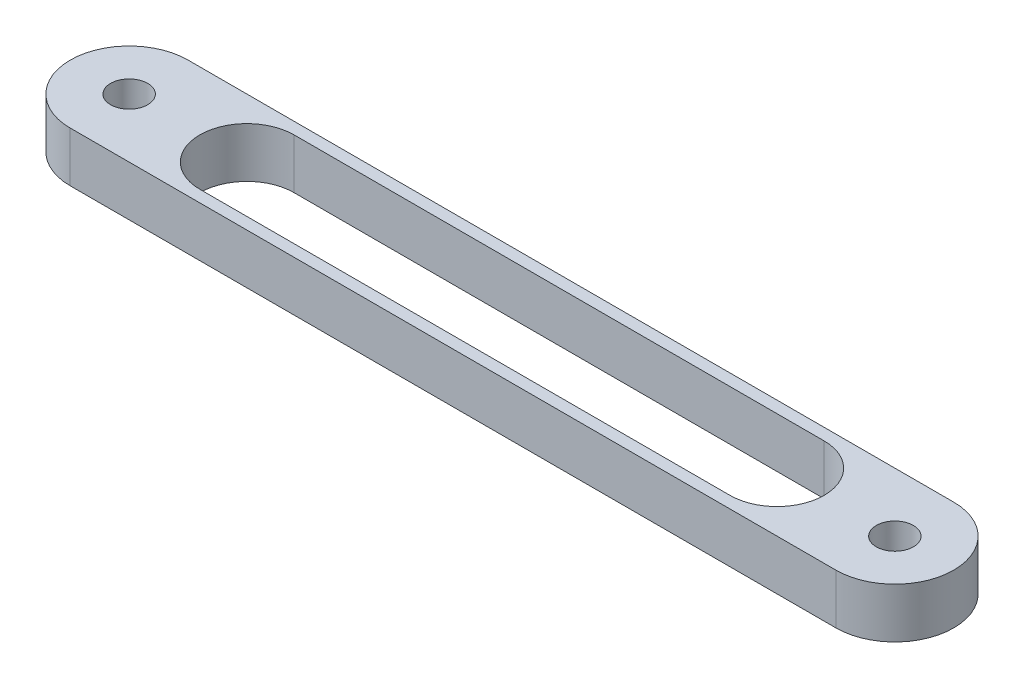
ISO-10303-21;
HEADER;
FILE_DESCRIPTION(('STEP AP214'),'2;1');
FILE_NAME('part.step','',(''),(''),'','','');
FILE_SCHEMA(('AUTOMOTIVE_DESIGN { 1 0 10303 214 1 1 1 1 }'));
ENDSEC;
DATA;
#1=APPLICATION_CONTEXT('core data for automotive mechanical design processes');
#2=APPLICATION_PROTOCOL_DEFINITION('international standard','automotive_design',2000,#1);
#3=PRODUCT_CONTEXT('',#1,'mechanical');
#4=PRODUCT('Part','Part','',(#3));
#5=PRODUCT_RELATED_PRODUCT_CATEGORY('part','',(#4));
#6=PRODUCT_DEFINITION_FORMATION('','',#4);
#7=PRODUCT_DEFINITION_CONTEXT('part definition',#1,'design');
#8=PRODUCT_DEFINITION('design','',#6,#7);
#9=PRODUCT_DEFINITION_SHAPE('','',#8);
#10=(LENGTH_UNIT() NAMED_UNIT(*) SI_UNIT(.MILLI.,.METRE.));
#11=(NAMED_UNIT(*) PLANE_ANGLE_UNIT() SI_UNIT($,.RADIAN.));
#12=(NAMED_UNIT(*) SI_UNIT($,.STERADIAN.) SOLID_ANGLE_UNIT());
#13=UNCERTAINTY_MEASURE_WITH_UNIT(LENGTH_MEASURE(1.E-05),#10,'distance_accuracy_value','');
#14=(GEOMETRIC_REPRESENTATION_CONTEXT(3) GLOBAL_UNCERTAINTY_ASSIGNED_CONTEXT((#13)) GLOBAL_UNIT_ASSIGNED_CONTEXT((#10,
#11,#12)) REPRESENTATION_CONTEXT('',''));
#15=CARTESIAN_POINT('',(0.,0.,0.));
#16=DIRECTION('',(0.,0.,1.));
#17=DIRECTION('',(1.,0.,0.));
#18=AXIS2_PLACEMENT_3D('',#15,#16,#17);
#19=CARTESIAN_POINT('',(0.,4.25,0.));
#20=DIRECTION('',(0.,1.,0.));
#21=DIRECTION('',(0.,0.,1.));
#22=AXIS2_PLACEMENT_3D('',#19,#20,#21);
#23=PLANE('',#22);
#24=CARTESIAN_POINT('',(0.,4.25,0.));
#25=DIRECTION('',(0.,1.,0.));
#26=DIRECTION('',(0.,0.,1.));
#27=AXIS2_PLACEMENT_3D('',#24,#25,#26);
#28=CIRCLE('',#27,3.15);
#29=CARTESIAN_POINT('',(0.,4.25,3.15));
#30=VERTEX_POINT('',#29);
#31=EDGE_CURVE('E265',#30,#30,#28,.T.);
#32=ORIENTED_EDGE('',*,*,#31,.F.);
#33=EDGE_LOOP('',(#32));
#34=FACE_BOUND('',#33,.T.);
#35=CARTESIAN_POINT('',(130.,4.25,0.));
#36=DIRECTION('',(0.,1.,0.));
#37=DIRECTION('',(0.,0.,-1.));
#38=AXIS2_PLACEMENT_3D('',#35,#36,#37);
#39=CIRCLE('',#38,3.14999999999999);
#40=CARTESIAN_POINT('',(130.,4.25,-3.14999999999999));
#41=VERTEX_POINT('',#40);
#42=EDGE_CURVE('E267',#41,#41,#39,.T.);
#43=ORIENTED_EDGE('',*,*,#42,.F.);
#44=EDGE_LOOP('',(#43));
#45=FACE_BOUND('',#44,.T.);
#46=CARTESIAN_POINT('',(0.,4.25,0.));
#47=DIRECTION('',(0.,1.,0.));
#48=DIRECTION('',(0.,0.,1.));
#49=AXIS2_PLACEMENT_3D('',#46,#47,#48);
#50=CIRCLE('',#49,10.);
#51=CARTESIAN_POINT('',(0.,4.25,-10.));
#52=VERTEX_POINT('',#51);
#53=CARTESIAN_POINT('',(0.,4.25,10.));
#54=VERTEX_POINT('',#53);
#55=EDGE_CURVE('E161',#52,#54,#50,.T.);
#56=ORIENTED_EDGE('',*,*,#55,.T.);
#57=DIRECTION('',(1.,0.,0.));
#58=VECTOR('',#57,1.);
#59=CARTESIAN_POINT('',(0.,4.25,10.));
#60=LINE('',#59,#58);
#61=CARTESIAN_POINT('',(130.,4.25,10.));
#62=VERTEX_POINT('',#61);
#63=EDGE_CURVE('E165',#54,#62,#60,.T.);
#64=ORIENTED_EDGE('',*,*,#63,.T.);
#65=CARTESIAN_POINT('',(130.,4.25,0.));
#66=DIRECTION('',(0.,1.,0.));
#67=DIRECTION('',(0.,0.,1.));
#68=AXIS2_PLACEMENT_3D('',#65,#66,#67);
#69=CIRCLE('',#68,10.);
#70=CARTESIAN_POINT('',(130.,4.25,-10.));
#71=VERTEX_POINT('',#70);
#72=EDGE_CURVE('E169',#62,#71,#69,.T.);
#73=ORIENTED_EDGE('',*,*,#72,.T.);
#74=DIRECTION('',(-1.,0.,0.));
#75=VECTOR('',#74,1.);
#76=CARTESIAN_POINT('',(0.,4.25,-10.));
#77=LINE('',#76,#75);
#78=EDGE_CURVE('E172',#71,#52,#77,.T.);
#79=ORIENTED_EDGE('',*,*,#78,.T.);
#80=EDGE_LOOP('',(#56,#64,#73,#79));
#81=FACE_BOUND('',#80,.T.);
#82=DIRECTION('',(1.,0.,0.));
#83=VECTOR('',#82,1.);
#84=CARTESIAN_POINT('',(20.,4.25,8.));
#85=LINE('',#84,#83);
#86=CARTESIAN_POINT('',(20.,4.25,8.));
#87=VERTEX_POINT('',#86);
#88=CARTESIAN_POINT('',(110.,4.25,8.));
#89=VERTEX_POINT('',#88);
#90=EDGE_CURVE('E120',#87,#89,#85,.T.);
#91=ORIENTED_EDGE('',*,*,#90,.F.);
#92=CARTESIAN_POINT('',(20.,4.25,0.));
#93=DIRECTION('',(0.,1.,0.));
#94=DIRECTION('',(0.,0.,1.));
#95=AXIS2_PLACEMENT_3D('',#92,#93,#94);
#96=CIRCLE('',#95,8.);
#97=CARTESIAN_POINT('',(20.,4.25,-8.));
#98=VERTEX_POINT('',#97);
#99=EDGE_CURVE('E111',#98,#87,#96,.T.);
#100=ORIENTED_EDGE('',*,*,#99,.F.);
#101=DIRECTION('',(-1.,0.,0.));
#102=VECTOR('',#101,1.);
#103=CARTESIAN_POINT('',(20.,4.25,-8.));
#104=LINE('',#103,#102);
#105=CARTESIAN_POINT('',(110.,4.25,-8.));
#106=VERTEX_POINT('',#105);
#107=EDGE_CURVE('E137',#106,#98,#104,.T.);
#108=ORIENTED_EDGE('',*,*,#107,.F.);
#109=CARTESIAN_POINT('',(110.,4.25,0.));
#110=DIRECTION('',(0.,1.,0.));
#111=DIRECTION('',(0.,0.,1.));
#112=AXIS2_PLACEMENT_3D('',#109,#110,#111);
#113=CIRCLE('',#112,8.);
#114=EDGE_CURVE('E133',#89,#106,#113,.T.);
#115=ORIENTED_EDGE('',*,*,#114,.F.);
#116=EDGE_LOOP('',(#91,#100,#108,#115));
#117=FACE_BOUND('',#116,.T.);
#118=ADVANCED_FACE('F45',(#34,#45,#81,#117),#23,.T.);
#119=CARTESIAN_POINT('',(0.,-4.25,0.));
#120=DIRECTION('',(0.,1.,0.));
#121=DIRECTION('',(0.,0.,1.));
#122=AXIS2_PLACEMENT_3D('',#119,#120,#121);
#123=PLANE('',#122);
#124=CARTESIAN_POINT('',(0.,-4.25,0.));
#125=DIRECTION('',(0.,1.,0.));
#126=DIRECTION('',(0.,0.,1.));
#127=AXIS2_PLACEMENT_3D('',#124,#125,#126);
#128=CIRCLE('',#127,3.15);
#129=CARTESIAN_POINT('',(0.,-4.25,3.15));
#130=VERTEX_POINT('',#129);
#131=EDGE_CURVE('E145',#130,#130,#128,.T.);
#132=ORIENTED_EDGE('',*,*,#131,.T.);
#133=EDGE_LOOP('',(#132));
#134=FACE_BOUND('',#133,.T.);
#135=CARTESIAN_POINT('',(130.,-4.25,0.));
#136=DIRECTION('',(0.,1.,0.));
#137=DIRECTION('',(0.,0.,-1.));
#138=AXIS2_PLACEMENT_3D('',#135,#136,#137);
#139=CIRCLE('',#138,3.14999999999999);
#140=CARTESIAN_POINT('',(130.,-4.25,-3.14999999999999));
#141=VERTEX_POINT('',#140);
#142=EDGE_CURVE('E273',#141,#141,#139,.T.);
#143=ORIENTED_EDGE('',*,*,#142,.T.);
#144=EDGE_LOOP('',(#143));
#145=FACE_BOUND('',#144,.T.);
#146=CARTESIAN_POINT('',(0.,-4.25,0.));
#147=DIRECTION('',(0.,1.,0.));
#148=DIRECTION('',(0.,0.,1.));
#149=AXIS2_PLACEMENT_3D('',#146,#147,#148);
#150=CIRCLE('',#149,10.);
#151=CARTESIAN_POINT('',(0.,-4.25,-10.));
#152=VERTEX_POINT('',#151);
#153=CARTESIAN_POINT('',(0.,-4.25,10.));
#154=VERTEX_POINT('',#153);
#155=EDGE_CURVE('E129',#152,#154,#150,.T.);
#156=ORIENTED_EDGE('',*,*,#155,.F.);
#157=DIRECTION('',(-1.,0.,0.));
#158=VECTOR('',#157,1.);
#159=CARTESIAN_POINT('',(0.,-4.25,-10.));
#160=LINE('',#159,#158);
#161=CARTESIAN_POINT('',(130.,-4.25,-10.));
#162=VERTEX_POINT('',#161);
#163=EDGE_CURVE('E166',#162,#152,#160,.T.);
#164=ORIENTED_EDGE('',*,*,#163,.F.);
#165=CARTESIAN_POINT('',(130.,-4.25,0.));
#166=DIRECTION('',(0.,1.,0.));
#167=DIRECTION('',(0.,0.,1.));
#168=AXIS2_PLACEMENT_3D('',#165,#166,#167);
#169=CIRCLE('',#168,10.);
#170=CARTESIAN_POINT('',(130.,-4.25,10.));
#171=VERTEX_POINT('',#170);
#172=EDGE_CURVE('E182',#171,#162,#169,.T.);
#173=ORIENTED_EDGE('',*,*,#172,.F.);
#174=DIRECTION('',(1.,0.,0.));
#175=VECTOR('',#174,1.);
#176=CARTESIAN_POINT('',(0.,-4.25,10.));
#177=LINE('',#176,#175);
#178=EDGE_CURVE('E179',#154,#171,#177,.T.);
#179=ORIENTED_EDGE('',*,*,#178,.F.);
#180=EDGE_LOOP('',(#156,#164,#173,#179));
#181=FACE_BOUND('',#180,.T.);
#182=CARTESIAN_POINT('',(20.,-4.25,0.));
#183=DIRECTION('',(0.,1.,0.));
#184=DIRECTION('',(0.,0.,1.));
#185=AXIS2_PLACEMENT_3D('',#182,#183,#184);
#186=CIRCLE('',#185,8.);
#187=CARTESIAN_POINT('',(20.,-4.25,-8.));
#188=VERTEX_POINT('',#187);
#189=CARTESIAN_POINT('',(20.,-4.25,8.));
#190=VERTEX_POINT('',#189);
#191=EDGE_CURVE('E69',#188,#190,#186,.T.);
#192=ORIENTED_EDGE('',*,*,#191,.T.);
#193=DIRECTION('',(1.,0.,0.));
#194=VECTOR('',#193,1.);
#195=CARTESIAN_POINT('',(20.,-4.25,8.));
#196=LINE('',#195,#194);
#197=CARTESIAN_POINT('',(110.,-4.25,8.));
#198=VERTEX_POINT('',#197);
#199=EDGE_CURVE('E127',#190,#198,#196,.T.);
#200=ORIENTED_EDGE('',*,*,#199,.T.);
#201=CARTESIAN_POINT('',(110.,-4.25,0.));
#202=DIRECTION('',(0.,1.,0.));
#203=DIRECTION('',(0.,0.,1.));
#204=AXIS2_PLACEMENT_3D('',#201,#202,#203);
#205=CIRCLE('',#204,8.);
#206=CARTESIAN_POINT('',(110.,-4.25,-8.));
#207=VERTEX_POINT('',#206);
#208=EDGE_CURVE('E148',#198,#207,#205,.T.);
#209=ORIENTED_EDGE('',*,*,#208,.T.);
#210=DIRECTION('',(-1.,0.,0.));
#211=VECTOR('',#210,1.);
#212=CARTESIAN_POINT('',(20.,-4.25,-8.));
#213=LINE('',#212,#211);
#214=EDGE_CURVE('E121',#207,#188,#213,.T.);
#215=ORIENTED_EDGE('',*,*,#214,.T.);
#216=EDGE_LOOP('',(#192,#200,#209,#215));
#217=FACE_BOUND('',#216,.T.);
#218=ADVANCED_FACE('F205',(#134,#145,#181,#217),#123,.F.);
#219=CARTESIAN_POINT('',(0.,4.25,0.));
#220=DIRECTION('',(0.,-1.,0.));
#221=DIRECTION('',(0.,0.,-1.));
#222=AXIS2_PLACEMENT_3D('',#219,#220,#221);
#223=CYLINDRICAL_SURFACE('',#222,10.);
#224=ORIENTED_EDGE('',*,*,#155,.T.);
#225=DIRECTION('',(0.,-1.,0.));
#226=VECTOR('',#225,1.);
#227=CARTESIAN_POINT('',(0.,4.25,10.));
#228=LINE('',#227,#226);
#229=EDGE_CURVE('E11',#54,#154,#228,.T.);
#230=ORIENTED_EDGE('',*,*,#229,.F.);
#231=ORIENTED_EDGE('',*,*,#55,.F.);
#232=DIRECTION('',(0.,-1.,0.));
#233=VECTOR('',#232,1.);
#234=CARTESIAN_POINT('',(0.,4.25,-10.));
#235=LINE('',#234,#233);
#236=EDGE_CURVE('E175',#52,#152,#235,.T.);
#237=ORIENTED_EDGE('',*,*,#236,.T.);
#238=EDGE_LOOP('',(#224,#230,#231,#237));
#239=FACE_BOUND('',#238,.T.);
#240=ADVANCED_FACE('F47',(#239),#223,.T.);
#241=CARTESIAN_POINT('',(0.,4.25,10.));
#242=DIRECTION('',(0.,0.,-1.));
#243=DIRECTION('',(-1.,0.,0.));
#244=AXIS2_PLACEMENT_3D('',#241,#242,#243);
#245=PLANE('',#244);
#246=ORIENTED_EDGE('',*,*,#178,.T.);
#247=DIRECTION('',(0.,-1.,0.));
#248=VECTOR('',#247,1.);
#249=CARTESIAN_POINT('',(130.,4.25,10.));
#250=LINE('',#249,#248);
#251=EDGE_CURVE('E54',#62,#171,#250,.T.);
#252=ORIENTED_EDGE('',*,*,#251,.F.);
#253=ORIENTED_EDGE('',*,*,#63,.F.);
#254=ORIENTED_EDGE('',*,*,#229,.T.);
#255=EDGE_LOOP('',(#246,#252,#253,#254));
#256=FACE_BOUND('',#255,.T.);
#257=ADVANCED_FACE('F215',(#256),#245,.F.);
#258=CARTESIAN_POINT('',(130.,4.25,0.));
#259=DIRECTION('',(0.,-1.,0.));
#260=DIRECTION('',(0.,0.,-1.));
#261=AXIS2_PLACEMENT_3D('',#258,#259,#260);
#262=CYLINDRICAL_SURFACE('',#261,10.);
#263=ORIENTED_EDGE('',*,*,#172,.T.);
#264=DIRECTION('',(0.,-1.,0.));
#265=VECTOR('',#264,1.);
#266=CARTESIAN_POINT('',(130.,4.25,-10.));
#267=LINE('',#266,#265);
#268=EDGE_CURVE('E190',#71,#162,#267,.T.);
#269=ORIENTED_EDGE('',*,*,#268,.F.);
#270=ORIENTED_EDGE('',*,*,#72,.F.);
#271=ORIENTED_EDGE('',*,*,#251,.T.);
#272=EDGE_LOOP('',(#263,#269,#270,#271));
#273=FACE_BOUND('',#272,.T.);
#274=ADVANCED_FACE('F199',(#273),#262,.T.);
#275=CARTESIAN_POINT('',(0.,4.25,-10.));
#276=DIRECTION('',(0.,0.,1.));
#277=DIRECTION('',(1.,0.,0.));
#278=AXIS2_PLACEMENT_3D('',#275,#276,#277);
#279=PLANE('',#278);
#280=ORIENTED_EDGE('',*,*,#163,.T.);
#281=ORIENTED_EDGE('',*,*,#236,.F.);
#282=ORIENTED_EDGE('',*,*,#78,.F.);
#283=ORIENTED_EDGE('',*,*,#268,.T.);
#284=EDGE_LOOP('',(#280,#281,#282,#283));
#285=FACE_BOUND('',#284,.T.);
#286=ADVANCED_FACE('F209',(#285),#279,.F.);
#287=CARTESIAN_POINT('',(20.,4.25,0.));
#288=DIRECTION('',(0.,-1.,0.));
#289=DIRECTION('',(0.,0.,-1.));
#290=AXIS2_PLACEMENT_3D('',#287,#288,#289);
#291=CYLINDRICAL_SURFACE('',#290,8.);
#292=ORIENTED_EDGE('',*,*,#191,.F.);
#293=DIRECTION('',(0.,-1.,0.));
#294=VECTOR('',#293,1.);
#295=CARTESIAN_POINT('',(20.,4.25,-8.));
#296=LINE('',#295,#294);
#297=EDGE_CURVE('E115',#98,#188,#296,.T.);
#298=ORIENTED_EDGE('',*,*,#297,.F.);
#299=ORIENTED_EDGE('',*,*,#99,.T.);
#300=DIRECTION('',(0.,-1.,0.));
#301=VECTOR('',#300,1.);
#302=CARTESIAN_POINT('',(20.,4.25,8.));
#303=LINE('',#302,#301);
#304=EDGE_CURVE('E114',#87,#190,#303,.T.);
#305=ORIENTED_EDGE('',*,*,#304,.T.);
#306=EDGE_LOOP('',(#292,#298,#299,#305));
#307=FACE_BOUND('',#306,.T.);
#308=ADVANCED_FACE('F113',(#307),#291,.F.);
#309=CARTESIAN_POINT('',(20.,4.25,8.));
#310=DIRECTION('',(0.,0.,-1.));
#311=DIRECTION('',(-1.,0.,0.));
#312=AXIS2_PLACEMENT_3D('',#309,#310,#311);
#313=PLANE('',#312);
#314=ORIENTED_EDGE('',*,*,#199,.F.);
#315=ORIENTED_EDGE('',*,*,#304,.F.);
#316=ORIENTED_EDGE('',*,*,#90,.T.);
#317=DIRECTION('',(0.,-1.,0.));
#318=VECTOR('',#317,1.);
#319=CARTESIAN_POINT('',(110.,4.25,8.));
#320=LINE('',#319,#318);
#321=EDGE_CURVE('E130',#89,#198,#320,.T.);
#322=ORIENTED_EDGE('',*,*,#321,.T.);
#323=EDGE_LOOP('',(#314,#315,#316,#322));
#324=FACE_BOUND('',#323,.T.);
#325=ADVANCED_FACE('F124',(#324),#313,.T.);
#326=CARTESIAN_POINT('',(110.,4.25,0.));
#327=DIRECTION('',(0.,-1.,0.));
#328=DIRECTION('',(0.,0.,-1.));
#329=AXIS2_PLACEMENT_3D('',#326,#327,#328);
#330=CYLINDRICAL_SURFACE('',#329,8.);
#331=ORIENTED_EDGE('',*,*,#208,.F.);
#332=ORIENTED_EDGE('',*,*,#321,.F.);
#333=ORIENTED_EDGE('',*,*,#114,.T.);
#334=DIRECTION('',(0.,-1.,0.));
#335=VECTOR('',#334,1.);
#336=CARTESIAN_POINT('',(110.,4.25,-8.));
#337=LINE('',#336,#335);
#338=EDGE_CURVE('E61',#106,#207,#337,.T.);
#339=ORIENTED_EDGE('',*,*,#338,.T.);
#340=EDGE_LOOP('',(#331,#332,#333,#339));
#341=FACE_BOUND('',#340,.T.);
#342=ADVANCED_FACE('F243',(#341),#330,.F.);
#343=CARTESIAN_POINT('',(20.,4.25,-8.));
#344=DIRECTION('',(0.,0.,1.));
#345=DIRECTION('',(1.,0.,0.));
#346=AXIS2_PLACEMENT_3D('',#343,#344,#345);
#347=PLANE('',#346);
#348=ORIENTED_EDGE('',*,*,#214,.F.);
#349=ORIENTED_EDGE('',*,*,#338,.F.);
#350=ORIENTED_EDGE('',*,*,#107,.T.);
#351=ORIENTED_EDGE('',*,*,#297,.T.);
#352=EDGE_LOOP('',(#348,#349,#350,#351));
#353=FACE_BOUND('',#352,.T.);
#354=ADVANCED_FACE('F247',(#353),#347,.T.);
#355=CARTESIAN_POINT('',(130.,-4.25,0.));
#356=DIRECTION('',(0.,1.,0.));
#357=DIRECTION('',(0.,0.,1.));
#358=AXIS2_PLACEMENT_3D('',#355,#356,#357);
#359=CYLINDRICAL_SURFACE('',#358,3.14999999999999);
#360=ORIENTED_EDGE('',*,*,#142,.F.);
#361=EDGE_LOOP('',(#360));
#362=FACE_BOUND('',#361,.T.);
#363=ORIENTED_EDGE('',*,*,#42,.T.);
#364=EDGE_LOOP('',(#363));
#365=FACE_BOUND('',#364,.T.);
#366=ADVANCED_FACE('F252',(#362,#365),#359,.F.);
#367=CARTESIAN_POINT('',(0.,-4.25,0.));
#368=DIRECTION('',(0.,1.,0.));
#369=DIRECTION('',(0.,0.,1.));
#370=AXIS2_PLACEMENT_3D('',#367,#368,#369);
#371=CYLINDRICAL_SURFACE('',#370,3.15);
#372=ORIENTED_EDGE('',*,*,#131,.F.);
#373=EDGE_LOOP('',(#372));
#374=FACE_BOUND('',#373,.T.);
#375=ORIENTED_EDGE('',*,*,#31,.T.);
#376=EDGE_LOOP('',(#375));
#377=FACE_BOUND('',#376,.T.);
#378=ADVANCED_FACE('F255',(#374,#377),#371,.F.);
#379=CLOSED_SHELL('',(#118,#218,#240,#257,#274,#286,#308,#325,#342,#354,#366,#378));
#380=MANIFOLD_SOLID_BREP('B2',#379);
#381=ADVANCED_BREP_SHAPE_REPRESENTATION('',(#18,#380),#14);
#382=SHAPE_DEFINITION_REPRESENTATION(#9,#381);
ENDSEC;
END-ISO-10303-21;
